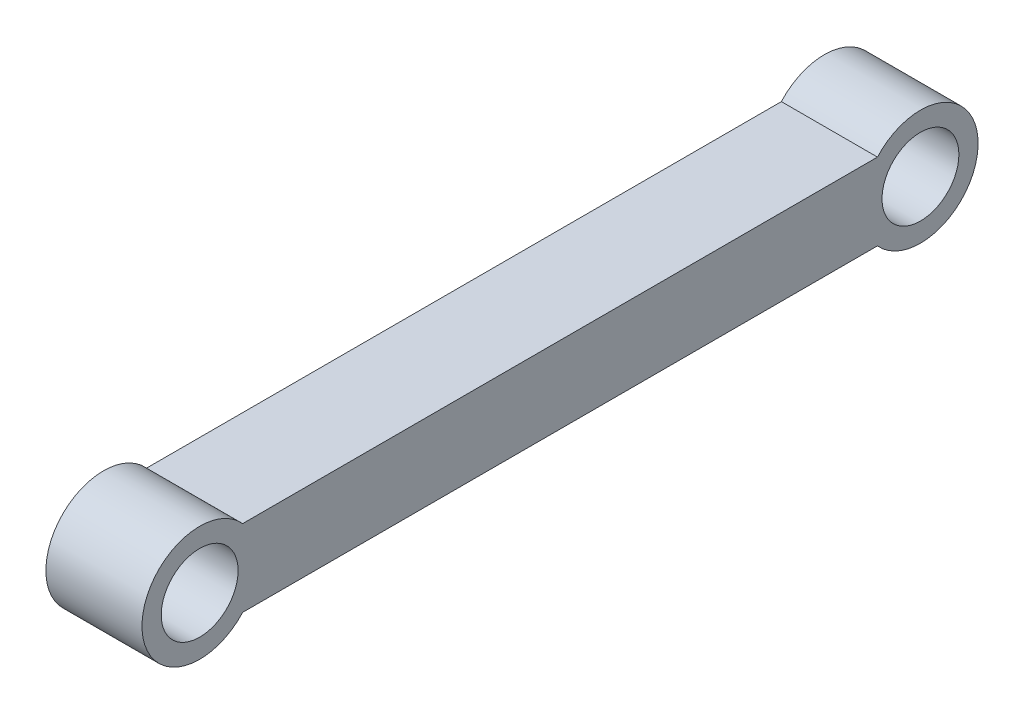
ISO-10303-21;
HEADER;
FILE_DESCRIPTION(('STEP AP214'),'2;1');
FILE_NAME('part.step','',(''),(''),'','','');
FILE_SCHEMA(('AUTOMOTIVE_DESIGN { 1 0 10303 214 1 1 1 1 }'));
ENDSEC;
DATA;
#1=APPLICATION_CONTEXT('core data for automotive mechanical design processes');
#2=APPLICATION_PROTOCOL_DEFINITION('international standard','automotive_design',2000,#1);
#3=PRODUCT_CONTEXT('',#1,'mechanical');
#4=PRODUCT('Part','Part','',(#3));
#5=PRODUCT_RELATED_PRODUCT_CATEGORY('part','',(#4));
#6=PRODUCT_DEFINITION_FORMATION('','',#4);
#7=PRODUCT_DEFINITION_CONTEXT('part definition',#1,'design');
#8=PRODUCT_DEFINITION('design','',#6,#7);
#9=PRODUCT_DEFINITION_SHAPE('','',#8);
#10=(LENGTH_UNIT() NAMED_UNIT(*) SI_UNIT(.MILLI.,.METRE.));
#11=(NAMED_UNIT(*) PLANE_ANGLE_UNIT() SI_UNIT($,.RADIAN.));
#12=(NAMED_UNIT(*) SI_UNIT($,.STERADIAN.) SOLID_ANGLE_UNIT());
#13=UNCERTAINTY_MEASURE_WITH_UNIT(LENGTH_MEASURE(1.E-05),#10,'distance_accuracy_value','');
#14=(GEOMETRIC_REPRESENTATION_CONTEXT(3) GLOBAL_UNCERTAINTY_ASSIGNED_CONTEXT((#13)) GLOBAL_UNIT_ASSIGNED_CONTEXT((#10,
#11,#12)) REPRESENTATION_CONTEXT('',''));
#15=CARTESIAN_POINT('',(0.,0.,0.));
#16=DIRECTION('',(0.,0.,1.));
#17=DIRECTION('',(1.,0.,0.));
#18=AXIS2_PLACEMENT_3D('',#15,#16,#17);
#19=CARTESIAN_POINT('',(100.,-226.263273144616,490.34553858004));
#20=DIRECTION('',(1.,0.,0.));
#21=DIRECTION('',(0.,0.,-1.));
#22=AXIS2_PLACEMENT_3D('',#19,#20,#21);
#23=PLANE('',#22);
#24=CARTESIAN_POINT('',(100.,-226.263273144619,-259.65446141996));
#25=DIRECTION('',(1.,0.,0.));
#26=DIRECTION('',(0.,0.,-1.));
#27=AXIS2_PLACEMENT_3D('',#24,#25,#26);
#28=CIRCLE('',#27,40.0000000000001);
#29=CARTESIAN_POINT('',(100.,-226.263273144619,-299.65446141996));
#30=VERTEX_POINT('',#29);
#31=EDGE_CURVE('E107',#30,#30,#28,.T.);
#32=ORIENTED_EDGE('',*,*,#31,.F.);
#33=EDGE_LOOP('',(#32));
#34=FACE_BOUND('',#33,.T.);
#35=CARTESIAN_POINT('',(100.,-226.263273144616,490.34553858004));
#36=DIRECTION('',(1.,0.,0.));
#37=DIRECTION('',(0.,0.,-1.));
#38=AXIS2_PLACEMENT_3D('',#35,#36,#37);
#39=CIRCLE('',#38,60.);
#40=CARTESIAN_POINT('',(100.,-186.263273144616,445.624179030044));
#41=VERTEX_POINT('',#40);
#42=CARTESIAN_POINT('',(100.,-266.263273144616,445.624179030044));
#43=VERTEX_POINT('',#42);
#44=EDGE_CURVE('E92',#41,#43,#39,.T.);
#45=ORIENTED_EDGE('',*,*,#44,.T.);
#46=DIRECTION('',(0.,0.,-1.));
#47=VECTOR('',#46,1.);
#48=CARTESIAN_POINT('',(100.,-266.263273144616,445.624179030044));
#49=LINE('',#48,#47);
#50=CARTESIAN_POINT('',(100.,-266.263273144618,-214.933101869964));
#51=VERTEX_POINT('',#50);
#52=EDGE_CURVE('E87',#43,#51,#49,.T.);
#53=ORIENTED_EDGE('',*,*,#52,.T.);
#54=CARTESIAN_POINT('',(100.,-226.263273144619,-259.65446141996));
#55=DIRECTION('',(1.,0.,0.));
#56=DIRECTION('',(0.,0.,-1.));
#57=AXIS2_PLACEMENT_3D('',#54,#55,#56);
#58=CIRCLE('',#57,60.);
#59=CARTESIAN_POINT('',(100.,-186.263273144618,-214.933101869965));
#60=VERTEX_POINT('',#59);
#61=EDGE_CURVE('E90',#51,#60,#58,.T.);
#62=ORIENTED_EDGE('',*,*,#61,.T.);
#63=DIRECTION('',(0.,0.,1.));
#64=VECTOR('',#63,1.);
#65=CARTESIAN_POINT('',(100.,-186.263273144616,445.624179030044));
#66=LINE('',#65,#64);
#67=EDGE_CURVE('E57',#60,#41,#66,.T.);
#68=ORIENTED_EDGE('',*,*,#67,.T.);
#69=EDGE_LOOP('',(#45,#53,#62,#68));
#70=FACE_BOUND('',#69,.T.);
#71=CARTESIAN_POINT('',(100.,-226.263273144616,490.34553858004));
#72=DIRECTION('',(1.,0.,0.));
#73=DIRECTION('',(0.,0.,-1.));
#74=AXIS2_PLACEMENT_3D('',#71,#72,#73);
#75=CIRCLE('',#74,39.9999999999999);
#76=CARTESIAN_POINT('',(100.,-226.263273144616,450.34553858004));
#77=VERTEX_POINT('',#76);
#78=EDGE_CURVE('E122',#77,#77,#75,.T.);
#79=ORIENTED_EDGE('',*,*,#78,.F.);
#80=EDGE_LOOP('',(#79));
#81=FACE_BOUND('',#80,.T.);
#82=ADVANCED_FACE('F40',(#34,#70,#81),#23,.T.);
#83=CARTESIAN_POINT('',(0.,-226.263273144616,490.34553858004));
#84=DIRECTION('',(1.,0.,0.));
#85=DIRECTION('',(0.,0.,-1.));
#86=AXIS2_PLACEMENT_3D('',#83,#84,#85);
#87=PLANE('',#86);
#88=CARTESIAN_POINT('',(0.,-226.263273144616,490.34553858004));
#89=DIRECTION('',(1.,0.,0.));
#90=DIRECTION('',(0.,0.,-1.));
#91=AXIS2_PLACEMENT_3D('',#88,#89,#90);
#92=CIRCLE('',#91,60.);
#93=CARTESIAN_POINT('',(0.,-186.263273144616,445.624179030044));
#94=VERTEX_POINT('',#93);
#95=CARTESIAN_POINT('',(0.,-266.263273144616,445.624179030044));
#96=VERTEX_POINT('',#95);
#97=EDGE_CURVE('E104',#94,#96,#92,.T.);
#98=ORIENTED_EDGE('',*,*,#97,.F.);
#99=DIRECTION('',(0.,0.,1.));
#100=VECTOR('',#99,1.);
#101=CARTESIAN_POINT('',(0.,-186.263273144616,445.624179030044));
#102=LINE('',#101,#100);
#103=CARTESIAN_POINT('',(0.,-186.263273144618,-214.933101869965));
#104=VERTEX_POINT('',#103);
#105=EDGE_CURVE('E80',#104,#94,#102,.T.);
#106=ORIENTED_EDGE('',*,*,#105,.F.);
#107=CARTESIAN_POINT('',(0.,-226.263273144619,-259.65446141996));
#108=DIRECTION('',(1.,0.,0.));
#109=DIRECTION('',(0.,0.,-1.));
#110=AXIS2_PLACEMENT_3D('',#107,#108,#109);
#111=CIRCLE('',#110,60.);
#112=CARTESIAN_POINT('',(0.,-266.263273144618,-214.933101869964));
#113=VERTEX_POINT('',#112);
#114=EDGE_CURVE('E74',#113,#104,#111,.T.);
#115=ORIENTED_EDGE('',*,*,#114,.F.);
#116=DIRECTION('',(0.,0.,-1.));
#117=VECTOR('',#116,1.);
#118=CARTESIAN_POINT('',(0.,-266.263273144616,445.624179030044));
#119=LINE('',#118,#117);
#120=EDGE_CURVE('E96',#96,#113,#119,.T.);
#121=ORIENTED_EDGE('',*,*,#120,.F.);
#122=EDGE_LOOP('',(#98,#106,#115,#121));
#123=FACE_BOUND('',#122,.T.);
#124=CARTESIAN_POINT('',(0.,-226.263273144619,-259.65446141996));
#125=DIRECTION('',(1.,0.,0.));
#126=DIRECTION('',(0.,0.,-1.));
#127=AXIS2_PLACEMENT_3D('',#124,#125,#126);
#128=CIRCLE('',#127,40.0000000000001);
#129=CARTESIAN_POINT('',(0.,-226.263273144619,-299.65446141996));
#130=VERTEX_POINT('',#129);
#131=EDGE_CURVE('E119',#130,#130,#128,.T.);
#132=ORIENTED_EDGE('',*,*,#131,.T.);
#133=EDGE_LOOP('',(#132));
#134=FACE_BOUND('',#133,.T.);
#135=CARTESIAN_POINT('',(0.,-226.263273144616,490.34553858004));
#136=DIRECTION('',(1.,0.,0.));
#137=DIRECTION('',(0.,0.,-1.));
#138=AXIS2_PLACEMENT_3D('',#135,#136,#137);
#139=CIRCLE('',#138,39.9999999999999);
#140=CARTESIAN_POINT('',(0.,-226.263273144616,450.34553858004));
#141=VERTEX_POINT('',#140);
#142=EDGE_CURVE('E125',#141,#141,#139,.T.);
#143=ORIENTED_EDGE('',*,*,#142,.T.);
#144=EDGE_LOOP('',(#143));
#145=FACE_BOUND('',#144,.T.);
#146=ADVANCED_FACE('F115',(#123,#134,#145),#87,.F.);
#147=CARTESIAN_POINT('',(100.,-226.263273144616,490.34553858004));
#148=DIRECTION('',(-1.,0.,0.));
#149=DIRECTION('',(0.,0.,1.));
#150=AXIS2_PLACEMENT_3D('',#147,#148,#149);
#151=CYLINDRICAL_SURFACE('',#150,60.);
#152=ORIENTED_EDGE('',*,*,#97,.T.);
#153=DIRECTION('',(-1.,0.,0.));
#154=VECTOR('',#153,1.);
#155=CARTESIAN_POINT('',(100.,-266.263273144616,445.624179030044));
#156=LINE('',#155,#154);
#157=EDGE_CURVE('E11',#43,#96,#156,.T.);
#158=ORIENTED_EDGE('',*,*,#157,.F.);
#159=ORIENTED_EDGE('',*,*,#44,.F.);
#160=DIRECTION('',(-1.,0.,0.));
#161=VECTOR('',#160,1.);
#162=CARTESIAN_POINT('',(100.,-186.263273144616,445.624179030044));
#163=LINE('',#162,#161);
#164=EDGE_CURVE('E100',#41,#94,#163,.T.);
#165=ORIENTED_EDGE('',*,*,#164,.T.);
#166=EDGE_LOOP('',(#152,#158,#159,#165));
#167=FACE_BOUND('',#166,.T.);
#168=ADVANCED_FACE('F42',(#167),#151,.T.);
#169=CARTESIAN_POINT('',(100.,-266.263273144616,445.624179030044));
#170=DIRECTION('',(0.,1.,0.));
#171=DIRECTION('',(0.,0.,1.));
#172=AXIS2_PLACEMENT_3D('',#169,#170,#171);
#173=PLANE('',#172);
#174=ORIENTED_EDGE('',*,*,#120,.T.);
#175=DIRECTION('',(-1.,0.,0.));
#176=VECTOR('',#175,1.);
#177=CARTESIAN_POINT('',(100.,-266.263273144618,-214.933101869964));
#178=LINE('',#177,#176);
#179=EDGE_CURVE('E49',#51,#113,#178,.T.);
#180=ORIENTED_EDGE('',*,*,#179,.F.);
#181=ORIENTED_EDGE('',*,*,#52,.F.);
#182=ORIENTED_EDGE('',*,*,#157,.T.);
#183=EDGE_LOOP('',(#174,#180,#181,#182));
#184=FACE_BOUND('',#183,.T.);
#185=ADVANCED_FACE('F95',(#184),#173,.F.);
#186=CARTESIAN_POINT('',(100.,-226.263273144619,-259.65446141996));
#187=DIRECTION('',(-1.,0.,0.));
#188=DIRECTION('',(0.,0.,1.));
#189=AXIS2_PLACEMENT_3D('',#186,#187,#188);
#190=CYLINDRICAL_SURFACE('',#189,60.);
#191=ORIENTED_EDGE('',*,*,#114,.T.);
#192=DIRECTION('',(-1.,0.,0.));
#193=VECTOR('',#192,1.);
#194=CARTESIAN_POINT('',(100.,-186.263273144618,-214.933101869965));
#195=LINE('',#194,#193);
#196=EDGE_CURVE('E97',#60,#104,#195,.T.);
#197=ORIENTED_EDGE('',*,*,#196,.F.);
#198=ORIENTED_EDGE('',*,*,#61,.F.);
#199=ORIENTED_EDGE('',*,*,#179,.T.);
#200=EDGE_LOOP('',(#191,#197,#198,#199));
#201=FACE_BOUND('',#200,.T.);
#202=ADVANCED_FACE('F98',(#201),#190,.T.);
#203=CARTESIAN_POINT('',(100.,-186.263273144616,445.624179030044));
#204=DIRECTION('',(0.,-1.,0.));
#205=DIRECTION('',(0.,0.,-1.));
#206=AXIS2_PLACEMENT_3D('',#203,#204,#205);
#207=PLANE('',#206);
#208=ORIENTED_EDGE('',*,*,#105,.T.);
#209=ORIENTED_EDGE('',*,*,#164,.F.);
#210=ORIENTED_EDGE('',*,*,#67,.F.);
#211=ORIENTED_EDGE('',*,*,#196,.T.);
#212=EDGE_LOOP('',(#208,#209,#210,#211));
#213=FACE_BOUND('',#212,.T.);
#214=ADVANCED_FACE('F112',(#213),#207,.F.);
#215=CARTESIAN_POINT('',(100.,-226.263273144619,-259.65446141996));
#216=DIRECTION('',(-1.,0.,0.));
#217=DIRECTION('',(0.,0.,1.));
#218=AXIS2_PLACEMENT_3D('',#215,#216,#217);
#219=CYLINDRICAL_SURFACE('',#218,40.0000000000001);
#220=ORIENTED_EDGE('',*,*,#31,.T.);
#221=EDGE_LOOP('',(#220));
#222=FACE_BOUND('',#221,.T.);
#223=ORIENTED_EDGE('',*,*,#131,.F.);
#224=EDGE_LOOP('',(#223));
#225=FACE_BOUND('',#224,.T.);
#226=ADVANCED_FACE('F142',(#222,#225),#219,.F.);
#227=CARTESIAN_POINT('',(100.,-226.263273144616,490.34553858004));
#228=DIRECTION('',(-1.,0.,0.));
#229=DIRECTION('',(0.,0.,1.));
#230=AXIS2_PLACEMENT_3D('',#227,#228,#229);
#231=CYLINDRICAL_SURFACE('',#230,39.9999999999999);
#232=ORIENTED_EDGE('',*,*,#78,.T.);
#233=EDGE_LOOP('',(#232));
#234=FACE_BOUND('',#233,.T.);
#235=ORIENTED_EDGE('',*,*,#142,.F.);
#236=EDGE_LOOP('',(#235));
#237=FACE_BOUND('',#236,.T.);
#238=ADVANCED_FACE('F131',(#234,#237),#231,.F.);
#239=CLOSED_SHELL('',(#82,#146,#168,#185,#202,#214,#226,#238));
#240=MANIFOLD_SOLID_BREP('B2',#239);
#241=ADVANCED_BREP_SHAPE_REPRESENTATION('',(#18,#240),#14);
#242=SHAPE_DEFINITION_REPRESENTATION(#9,#241);
ENDSEC;
END-ISO-10303-21;
